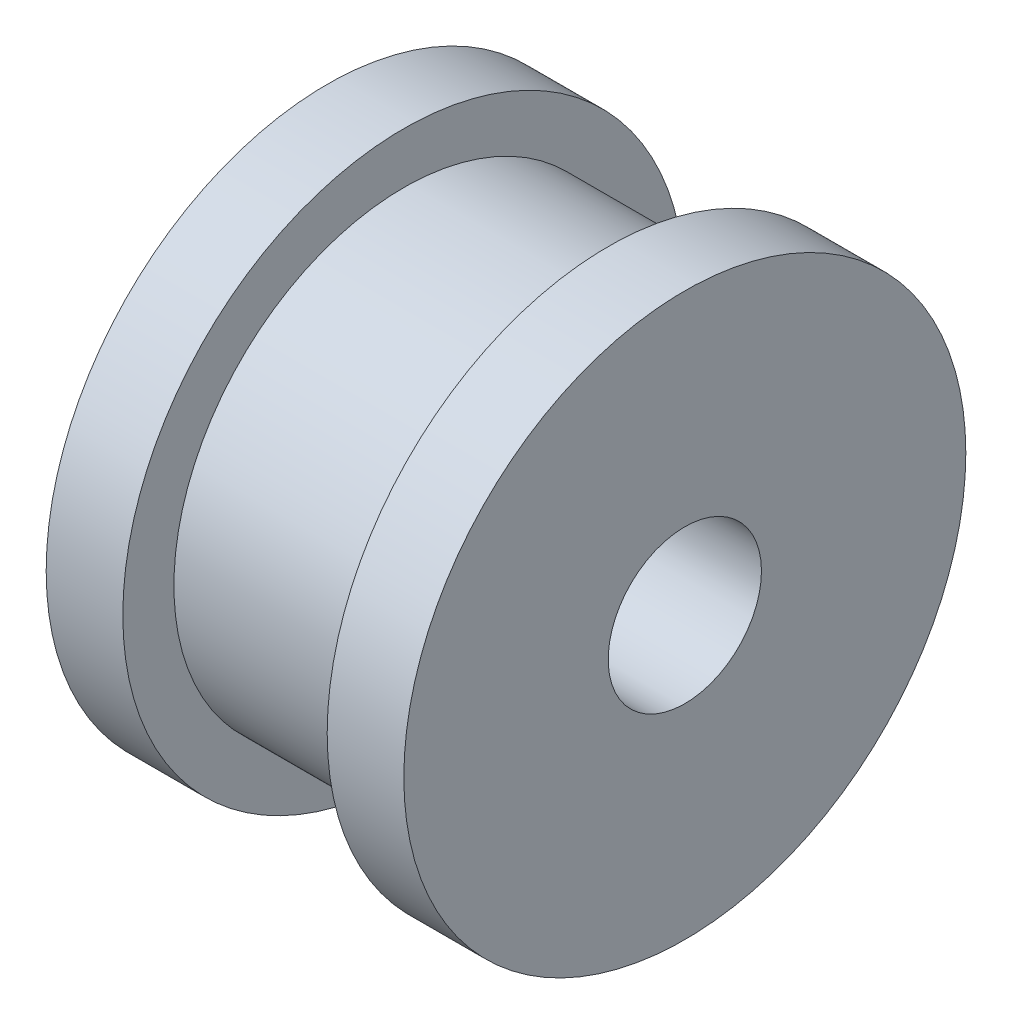
ISO-10303-21;
HEADER;
FILE_DESCRIPTION(('STEP AP214'),'2;1');
FILE_NAME('part.step','',(''),(''),'','','');
FILE_SCHEMA(('AUTOMOTIVE_DESIGN { 1 0 10303 214 1 1 1 1 }'));
ENDSEC;
DATA;
#1=APPLICATION_CONTEXT('core data for automotive mechanical design processes');
#2=APPLICATION_PROTOCOL_DEFINITION('international standard','automotive_design',2000,#1);
#3=PRODUCT_CONTEXT('',#1,'mechanical');
#4=PRODUCT('Part','Part','',(#3));
#5=PRODUCT_RELATED_PRODUCT_CATEGORY('part','',(#4));
#6=PRODUCT_DEFINITION_FORMATION('','',#4);
#7=PRODUCT_DEFINITION_CONTEXT('part definition',#1,'design');
#8=PRODUCT_DEFINITION('design','',#6,#7);
#9=PRODUCT_DEFINITION_SHAPE('','',#8);
#10=(LENGTH_UNIT() NAMED_UNIT(*) SI_UNIT(.MILLI.,.METRE.));
#11=(NAMED_UNIT(*) PLANE_ANGLE_UNIT() SI_UNIT($,.RADIAN.));
#12=(NAMED_UNIT(*) SI_UNIT($,.STERADIAN.) SOLID_ANGLE_UNIT());
#13=UNCERTAINTY_MEASURE_WITH_UNIT(LENGTH_MEASURE(1.E-05),#10,'distance_accuracy_value','');
#14=(GEOMETRIC_REPRESENTATION_CONTEXT(3) GLOBAL_UNCERTAINTY_ASSIGNED_CONTEXT((#13)) GLOBAL_UNIT_ASSIGNED_CONTEXT((#10,
#11,#12)) REPRESENTATION_CONTEXT('',''));
#15=CARTESIAN_POINT('',(0.,0.,0.));
#16=DIRECTION('',(0.,0.,1.));
#17=DIRECTION('',(1.,0.,0.));
#18=AXIS2_PLACEMENT_3D('',#15,#16,#17);
#19=CARTESIAN_POINT('',(8.,0.,0.));
#20=DIRECTION('',(-1.,0.,0.));
#21=DIRECTION('',(0.,0.,1.));
#22=AXIS2_PLACEMENT_3D('',#19,#20,#21);
#23=CYLINDRICAL_SURFACE('',#22,9.);
#24=CARTESIAN_POINT('',(8.,0.,0.));
#25=DIRECTION('',(1.,0.,0.));
#26=DIRECTION('',(0.,0.,-1.));
#27=AXIS2_PLACEMENT_3D('',#24,#25,#26);
#28=CIRCLE('',#27,9.);
#29=CARTESIAN_POINT('',(8.,0.,-9.));
#30=VERTEX_POINT('',#29);
#31=EDGE_CURVE('E10',#30,#30,#28,.T.);
#32=ORIENTED_EDGE('',*,*,#31,.F.);
#33=EDGE_LOOP('',(#32));
#34=FACE_BOUND('',#33,.T.);
#35=CARTESIAN_POINT('',(0.,0.,0.));
#36=DIRECTION('',(1.,0.,0.));
#37=DIRECTION('',(0.,0.,-1.));
#38=AXIS2_PLACEMENT_3D('',#35,#36,#37);
#39=CIRCLE('',#38,9.);
#40=CARTESIAN_POINT('',(0.,0.,-9.));
#41=VERTEX_POINT('',#40);
#42=EDGE_CURVE('E34',#41,#41,#39,.T.);
#43=ORIENTED_EDGE('',*,*,#42,.T.);
#44=EDGE_LOOP('',(#43));
#45=FACE_BOUND('',#44,.T.);
#46=ADVANCED_FACE('F31',(#34,#45),#23,.T.);
#47=CARTESIAN_POINT('',(11.,0.,0.));
#48=DIRECTION('',(-1.,0.,0.));
#49=DIRECTION('',(0.,0.,1.));
#50=AXIS2_PLACEMENT_3D('',#47,#48,#49);
#51=CYLINDRICAL_SURFACE('',#50,11.);
#52=CARTESIAN_POINT('',(11.,0.,0.));
#53=DIRECTION('',(1.,0.,0.));
#54=DIRECTION('',(0.,0.,-1.));
#55=AXIS2_PLACEMENT_3D('',#52,#53,#54);
#56=CIRCLE('',#55,11.);
#57=CARTESIAN_POINT('',(11.,0.,-11.));
#58=VERTEX_POINT('',#57);
#59=EDGE_CURVE('E38',#58,#58,#56,.T.);
#60=ORIENTED_EDGE('',*,*,#59,.F.);
#61=EDGE_LOOP('',(#60));
#62=FACE_BOUND('',#61,.T.);
#63=CARTESIAN_POINT('',(8.,0.,0.));
#64=DIRECTION('',(1.,0.,0.));
#65=DIRECTION('',(0.,0.,-1.));
#66=AXIS2_PLACEMENT_3D('',#63,#64,#65);
#67=CIRCLE('',#66,11.);
#68=CARTESIAN_POINT('',(8.,0.,-11.));
#69=VERTEX_POINT('',#68);
#70=EDGE_CURVE('E42',#69,#69,#67,.T.);
#71=ORIENTED_EDGE('',*,*,#70,.T.);
#72=EDGE_LOOP('',(#71));
#73=FACE_BOUND('',#72,.T.);
#74=ADVANCED_FACE('F75',(#62,#73),#51,.T.);
#75=CARTESIAN_POINT('',(11.,0.,0.));
#76=DIRECTION('',(1.,0.,0.));
#77=DIRECTION('',(0.,0.,-1.));
#78=AXIS2_PLACEMENT_3D('',#75,#76,#77);
#79=PLANE('',#78);
#80=CARTESIAN_POINT('',(11.,0.,0.));
#81=DIRECTION('',(1.,0.,0.));
#82=DIRECTION('',(0.,0.,-1.));
#83=AXIS2_PLACEMENT_3D('',#80,#81,#82);
#84=CIRCLE('',#83,3.);
#85=CARTESIAN_POINT('',(11.,0.,-3.));
#86=VERTEX_POINT('',#85);
#87=EDGE_CURVE('E51',#86,#86,#84,.T.);
#88=ORIENTED_EDGE('',*,*,#87,.F.);
#89=EDGE_LOOP('',(#88));
#90=FACE_BOUND('',#89,.T.);
#91=ORIENTED_EDGE('',*,*,#59,.T.);
#92=EDGE_LOOP('',(#91));
#93=FACE_BOUND('',#92,.T.);
#94=ADVANCED_FACE('F80',(#90,#93),#79,.T.);
#95=CARTESIAN_POINT('',(8.,0.,0.));
#96=DIRECTION('',(1.,0.,0.));
#97=DIRECTION('',(0.,0.,-1.));
#98=AXIS2_PLACEMENT_3D('',#95,#96,#97);
#99=PLANE('',#98);
#100=ORIENTED_EDGE('',*,*,#31,.T.);
#101=EDGE_LOOP('',(#100));
#102=FACE_BOUND('',#101,.T.);
#103=ORIENTED_EDGE('',*,*,#70,.F.);
#104=EDGE_LOOP('',(#103));
#105=FACE_BOUND('',#104,.T.);
#106=ADVANCED_FACE('F90',(#102,#105),#99,.F.);
#107=CARTESIAN_POINT('',(-3.,0.,0.));
#108=DIRECTION('',(1.,0.,0.));
#109=DIRECTION('',(0.,0.,-1.));
#110=AXIS2_PLACEMENT_3D('',#107,#108,#109);
#111=CYLINDRICAL_SURFACE('',#110,11.);
#112=CARTESIAN_POINT('',(-3.,0.,0.));
#113=DIRECTION('',(-1.,0.,0.));
#114=DIRECTION('',(0.,0.,1.));
#115=AXIS2_PLACEMENT_3D('',#112,#113,#114);
#116=CIRCLE('',#115,11.);
#117=CARTESIAN_POINT('',(-3.,0.,11.));
#118=VERTEX_POINT('',#117);
#119=EDGE_CURVE('E50',#118,#118,#116,.T.);
#120=ORIENTED_EDGE('',*,*,#119,.F.);
#121=EDGE_LOOP('',(#120));
#122=FACE_BOUND('',#121,.T.);
#123=CARTESIAN_POINT('',(0.,0.,0.));
#124=DIRECTION('',(-1.,0.,0.));
#125=DIRECTION('',(0.,0.,1.));
#126=AXIS2_PLACEMENT_3D('',#123,#124,#125);
#127=CIRCLE('',#126,11.);
#128=CARTESIAN_POINT('',(0.,0.,11.));
#129=VERTEX_POINT('',#128);
#130=EDGE_CURVE('E47',#129,#129,#127,.T.);
#131=ORIENTED_EDGE('',*,*,#130,.T.);
#132=EDGE_LOOP('',(#131));
#133=FACE_BOUND('',#132,.T.);
#134=ADVANCED_FACE('F88',(#122,#133),#111,.T.);
#135=CARTESIAN_POINT('',(-3.,0.,0.));
#136=DIRECTION('',(-1.,0.,0.));
#137=DIRECTION('',(0.,0.,1.));
#138=AXIS2_PLACEMENT_3D('',#135,#136,#137);
#139=PLANE('',#138);
#140=CARTESIAN_POINT('',(-3.,0.,0.));
#141=DIRECTION('',(1.,0.,0.));
#142=DIRECTION('',(0.,0.,-1.));
#143=AXIS2_PLACEMENT_3D('',#140,#141,#142);
#144=CIRCLE('',#143,3.);
#145=CARTESIAN_POINT('',(-3.,0.,-3.));
#146=VERTEX_POINT('',#145);
#147=EDGE_CURVE('E56',#146,#146,#144,.T.);
#148=ORIENTED_EDGE('',*,*,#147,.T.);
#149=EDGE_LOOP('',(#148));
#150=FACE_BOUND('',#149,.T.);
#151=ORIENTED_EDGE('',*,*,#119,.T.);
#152=EDGE_LOOP('',(#151));
#153=FACE_BOUND('',#152,.T.);
#154=ADVANCED_FACE('F60',(#150,#153),#139,.T.);
#155=CARTESIAN_POINT('',(0.,0.,0.));
#156=DIRECTION('',(-1.,0.,0.));
#157=DIRECTION('',(0.,0.,1.));
#158=AXIS2_PLACEMENT_3D('',#155,#156,#157);
#159=PLANE('',#158);
#160=ORIENTED_EDGE('',*,*,#42,.F.);
#161=EDGE_LOOP('',(#160));
#162=FACE_BOUND('',#161,.T.);
#163=ORIENTED_EDGE('',*,*,#130,.F.);
#164=EDGE_LOOP('',(#163));
#165=FACE_BOUND('',#164,.T.);
#166=ADVANCED_FACE('F65',(#162,#165),#159,.F.);
#167=CARTESIAN_POINT('',(11.,0.,0.));
#168=DIRECTION('',(-1.,0.,0.));
#169=DIRECTION('',(0.,0.,1.));
#170=AXIS2_PLACEMENT_3D('',#167,#168,#169);
#171=CYLINDRICAL_SURFACE('',#170,3.);
#172=ORIENTED_EDGE('',*,*,#87,.T.);
#173=EDGE_LOOP('',(#172));
#174=FACE_BOUND('',#173,.T.);
#175=ORIENTED_EDGE('',*,*,#147,.F.);
#176=EDGE_LOOP('',(#175));
#177=FACE_BOUND('',#176,.T.);
#178=ADVANCED_FACE('F63',(#174,#177),#171,.F.);
#179=CLOSED_SHELL('',(#46,#74,#94,#106,#134,#154,#166,#178));
#180=MANIFOLD_SOLID_BREP('B2',#179);
#181=ADVANCED_BREP_SHAPE_REPRESENTATION('',(#18,#180),#14);
#182=SHAPE_DEFINITION_REPRESENTATION(#9,#181);
ENDSEC;
END-ISO-10303-21;
